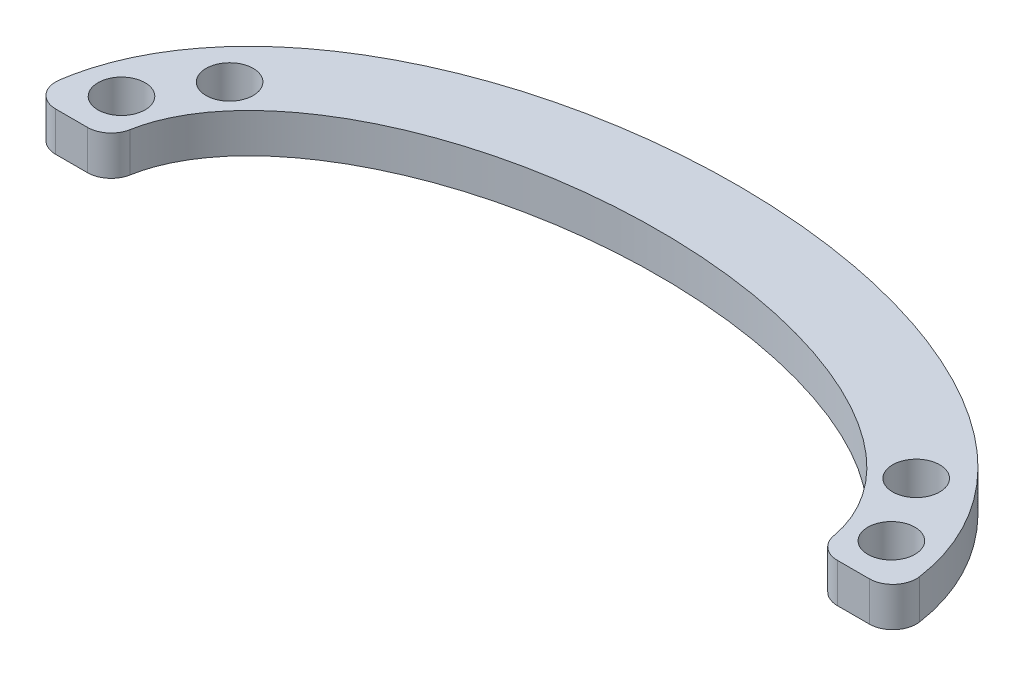
ISO-10303-21;
HEADER;
FILE_DESCRIPTION(('STEP AP214'),'2;1');
FILE_NAME('part.step','',(''),(''),'','','');
FILE_SCHEMA(('AUTOMOTIVE_DESIGN { 1 0 10303 214 1 1 1 1 }'));
ENDSEC;
DATA;
#1=APPLICATION_CONTEXT('core data for automotive mechanical design processes');
#2=APPLICATION_PROTOCOL_DEFINITION('international standard','automotive_design',2000,#1);
#3=PRODUCT_CONTEXT('',#1,'mechanical');
#4=PRODUCT('Part','Part','',(#3));
#5=PRODUCT_RELATED_PRODUCT_CATEGORY('part','',(#4));
#6=PRODUCT_DEFINITION_FORMATION('','',#4);
#7=PRODUCT_DEFINITION_CONTEXT('part definition',#1,'design');
#8=PRODUCT_DEFINITION('design','',#6,#7);
#9=PRODUCT_DEFINITION_SHAPE('','',#8);
#10=(LENGTH_UNIT() NAMED_UNIT(*) SI_UNIT(.MILLI.,.METRE.));
#11=(NAMED_UNIT(*) PLANE_ANGLE_UNIT() SI_UNIT($,.RADIAN.));
#12=(NAMED_UNIT(*) SI_UNIT($,.STERADIAN.) SOLID_ANGLE_UNIT());
#13=UNCERTAINTY_MEASURE_WITH_UNIT(LENGTH_MEASURE(1.E-05),#10,'distance_accuracy_value','');
#14=(GEOMETRIC_REPRESENTATION_CONTEXT(3) GLOBAL_UNCERTAINTY_ASSIGNED_CONTEXT((#13)) GLOBAL_UNIT_ASSIGNED_CONTEXT((#10,
#11,#12)) REPRESENTATION_CONTEXT('',''));
#15=CARTESIAN_POINT('',(0.,0.,0.));
#16=DIRECTION('',(0.,0.,1.));
#17=DIRECTION('',(1.,0.,0.));
#18=AXIS2_PLACEMENT_3D('',#15,#16,#17);
#19=CARTESIAN_POINT('',(54.9997938139714,5.,0.0992526313511364));
#20=DIRECTION('',(0.,-1.,0.));
#21=DIRECTION('',(0.,0.,-1.));
#22=AXIS2_PLACEMENT_3D('',#19,#20,#21);
#23=PLANE('',#22);
#24=CARTESIAN_POINT('',(49.0014703684187,5.,-5.59216846283063));
#25=DIRECTION('',(0.,-1.,0.));
#26=DIRECTION('',(0.,0.,1.));
#27=AXIS2_PLACEMENT_3D('',#24,#25,#26);
#28=CIRCLE('',#27,3.);
#29=CARTESIAN_POINT('',(49.0014703684187,5.,-2.59216846283063));
#30=VERTEX_POINT('',#29);
#31=EDGE_CURVE('E243',#30,#30,#28,.T.);
#32=ORIENTED_EDGE('',*,*,#31,.T.);
#33=EDGE_LOOP('',(#32));
#34=FACE_BOUND('',#33,.T.);
#35=CARTESIAN_POINT('',(43.701014770333,5.,-14.0525110520827));
#36=DIRECTION('',(0.,-1.,0.));
#37=DIRECTION('',(0.,0.,1.));
#38=AXIS2_PLACEMENT_3D('',#35,#36,#37);
#39=CIRCLE('',#38,3.);
#40=CARTESIAN_POINT('',(43.701014770333,5.,-11.0525110520827));
#41=VERTEX_POINT('',#40);
#42=EDGE_CURVE('E241',#41,#41,#39,.T.);
#43=ORIENTED_EDGE('',*,*,#42,.T.);
#44=EDGE_LOOP('',(#43));
#45=FACE_BOUND('',#44,.T.);
#46=CARTESIAN_POINT('',(-49.0014703684187,5.,-5.59216846283063));
#47=DIRECTION('',(0.,1.,0.));
#48=DIRECTION('',(0.,0.,1.));
#49=AXIS2_PLACEMENT_3D('',#46,#47,#48);
#50=CIRCLE('',#49,3.);
#51=CARTESIAN_POINT('',(-49.0014703684187,5.,-2.59216846283063));
#52=VERTEX_POINT('',#51);
#53=EDGE_CURVE('E250',#52,#52,#50,.T.);
#54=ORIENTED_EDGE('',*,*,#53,.F.);
#55=EDGE_LOOP('',(#54));
#56=FACE_BOUND('',#55,.T.);
#57=CARTESIAN_POINT('',(-43.701014770333,5.,-14.0525110520827));
#58=DIRECTION('',(0.,1.,0.));
#59=DIRECTION('',(0.,0.,1.));
#60=AXIS2_PLACEMENT_3D('',#57,#58,#59);
#61=CIRCLE('',#60,3.);
#62=CARTESIAN_POINT('',(-43.701014770333,5.,-11.0525110520827));
#63=VERTEX_POINT('',#62);
#64=EDGE_CURVE('E256',#63,#63,#61,.T.);
#65=ORIENTED_EDGE('',*,*,#64,.F.);
#66=EDGE_LOOP('',(#65));
#67=FACE_BOUND('',#66,.T.);
#68=CARTESIAN_POINT('',(0.,5.,0.));
#69=DIRECTION('',(0.,1.,0.));
#70=DIRECTION('',(1.,0.,0.));
#71=AXIS2_PLACEMENT_3D('',#68,#69,#70);
#72=ELLIPSE('',#71,45.,25.);
#73=CARTESIAN_POINT('',(44.7795008874869,5.,-2.47183519239893));
#74=VERTEX_POINT('',#73);
#75=CARTESIAN_POINT('',(-44.7795008874869,5.,-2.47183519239892));
#76=VERTEX_POINT('',#75);
#77=EDGE_CURVE('E164',#74,#76,#72,.T.);
#78=ORIENTED_EDGE('',*,*,#77,.F.);
#79=CARTESIAN_POINT('',(47.7326419162912,5.,-3.0000000000041));
#80=DIRECTION('',(0.,-1.,0.));
#81=DIRECTION('',(0.,0.,-1.));
#82=AXIS2_PLACEMENT_3D('',#79,#80,#81);
#83=CIRCLE('',#82,3.);
#84=CARTESIAN_POINT('',(47.7326419162912,5.,-4.09734638638987E-12));
#85=VERTEX_POINT('',#84);
#86=EDGE_CURVE('E52',#74,#85,#83,.F.);
#87=ORIENTED_EDGE('',*,*,#86,.T.);
#88=DIRECTION('',(-1.,0.,0.));
#89=VECTOR('',#88,1.);
#90=CARTESIAN_POINT('',(55.0000002617232,5.,-4.09823638110347E-12));
#91=LINE('',#90,#89);
#92=CARTESIAN_POINT('',(51.7838755501169,5.,-4.09784251942009E-12));
#93=VERTEX_POINT('',#92);
#94=EDGE_CURVE('E133',#93,#85,#91,.T.);
#95=ORIENTED_EDGE('',*,*,#94,.F.);
#96=CARTESIAN_POINT('',(51.7838755501169,5.,-3.00000000000397));
#97=DIRECTION('',(0.,-1.,0.));
#98=DIRECTION('',(0.,0.,-1.));
#99=AXIS2_PLACEMENT_3D('',#96,#97,#98);
#100=CIRCLE('',#99,3.);
#101=CARTESIAN_POINT('',(54.7530928049076,5.,-3.42865941475347));
#102=VERTEX_POINT('',#101);
#103=EDGE_CURVE('E59',#93,#102,#100,.F.);
#104=ORIENTED_EDGE('',*,*,#103,.T.);
#105=CARTESIAN_POINT('',(-55.,5.,0.));
#106=CARTESIAN_POINT('',(-55.,5.,1.51839004587295));
#107=CARTESIAN_POINT('',(-54.8560824878836,5.,3.01126789041497));
#108=CARTESIAN_POINT('',(-54.4384196051892,5.,5.2148140226484));
#109=CARTESIAN_POINT('',(-54.2654118343232,5.,5.94334002541323));
#110=CARTESIAN_POINT('',(-53.9557489127903,5.,7.02723873430152));
#111=CARTESIAN_POINT('',(-53.8441617057927,5.,7.3870552250377));
#112=CARTESIAN_POINT('',(-53.6042545379376,5.,8.10372199774911));
#113=CARTESIAN_POINT('',(-53.4756356643839,5.,8.46127527787602));
#114=CARTESIAN_POINT('',(-52.7968168979553,5.,10.2260969988139));
#115=CARTESIAN_POINT('',(-52.1375268766547,5.,11.5742085055168));
#116=CARTESIAN_POINT('',(-50.9945389890282,5.,13.511889744759));
#117=CARTESIAN_POINT('',(-50.5877443171271,5.,14.143634903753));
#118=CARTESIAN_POINT('',(-49.7247658837706,5.,15.3800391438514));
#119=CARTESIAN_POINT('',(-49.2670809389217,5.,15.9863082132591));
#120=CARTESIAN_POINT('',(-47.8432674447431,5.,17.7415324536667));
#121=CARTESIAN_POINT('',(-46.8221701298986,5.,18.8348330741654));
#122=CARTESIAN_POINT('',(-44.6584427358043,5.,20.8915153498061));
#123=CARTESIAN_POINT('',(-43.5156810565625,5.,21.85475632408));
#124=CARTESIAN_POINT('',(-41.1229374449941,5.,23.6666194337144));
#125=CARTESIAN_POINT('',(-39.8685055112097,5.,24.5171502589666));
#126=CARTESIAN_POINT('',(-37.3136126978861,5.,26.0850541054977));
#127=CARTESIAN_POINT('',(-36.0076876258533,5.,26.807071771656));
#128=CARTESIAN_POINT('',(-32.0162249036844,5.,28.8128721428701));
#129=CARTESIAN_POINT('',(-29.2577428708342,5.,29.938018335481));
#130=CARTESIAN_POINT('',(-25.0000132266153,5.,31.3647521038685));
#131=CARTESIAN_POINT('',(-23.5561053812594,5.,31.7973865779849));
#132=CARTESIAN_POINT('',(-20.6617609218868,5.,32.571728847771));
#133=CARTESIAN_POINT('',(-19.2094143576161,5.,32.9143925044692));
#134=CARTESIAN_POINT('',(-14.8381490768705,5.,33.8200208722962));
#135=CARTESIAN_POINT('',(-11.9051113125477,5.,34.2615393947465));
#136=CARTESIAN_POINT('',(-6.00487674782412,5.,34.8507545909456));
#137=CARTESIAN_POINT('',(-3.03765424271733,5.,34.9982301634831));
#138=CARTESIAN_POINT('',(1.43859136500834,5.,35.0008613366531));
#139=CARTESIAN_POINT('',(2.93742950124633,5.,34.9649827989931));
#140=CARTESIAN_POINT('',(5.93274243076342,5.,34.818477910016));
#141=CARTESIAN_POINT('',(7.42232041397916,5.,34.7083189066517));
#142=CARTESIAN_POINT('',(11.8668118591396,5.,34.2670899669549));
#143=CARTESIAN_POINT('',(14.7976800583453,5.,33.8261692003324));
#144=CARTESIAN_POINT('',(20.590703377887,5.,32.6304118306277));
#145=CARTESIAN_POINT('',(23.4529806199709,5.,31.8761331409922));
#146=CARTESIAN_POINT('',(27.6858267359427,5.,30.4680020970972));
#147=CARTESIAN_POINT('',(29.0866121337407,5.,29.9521939919706));
#148=CARTESIAN_POINT('',(31.1704839851247,5.,29.0994182184045));
#149=CARTESIAN_POINT('',(31.8636100681559,5.,28.8012951396562));
#150=CARTESIAN_POINT('',(33.2354068818576,5.,28.1803073415523));
#151=CARTESIAN_POINT('',(33.9139897397978,5.,27.8575592398411));
#152=CARTESIAN_POINT('',(37.2685182320089,5.,26.1795190666362));
#153=CARTESIAN_POINT('',(39.8315738319208,5.,24.6351260300423));
#154=CARTESIAN_POINT('',(42.8363856511167,5.,22.3712789629488));
#155=CARTESIAN_POINT('',(43.4288197160655,5.,21.9001912215936));
#156=CARTESIAN_POINT('',(44.5818359345461,5.,20.9291180391796));
#157=CARTESIAN_POINT('',(45.1425211400724,5.,20.4292335071571));
#158=CARTESIAN_POINT('',(46.7744855540985,5.,18.8841580578949));
#159=CARTESIAN_POINT('',(47.7959389951299,5.,17.7937859794949));
#160=CARTESIAN_POINT('',(49.2139074585589,5.,16.0546626304643));
#161=CARTESIAN_POINT('',(49.6674694737544,5.,15.4576406056893));
#162=CARTESIAN_POINT('',(50.5330551815444,5.,14.2259303094738));
#163=CARTESIAN_POINT('',(50.946683634309,5.,13.5883553089372));
#164=CARTESIAN_POINT('',(52.1030475401389,5.,11.6412381258365));
#165=CARTESIAN_POINT('',(52.764010936102,5.,10.2961184406788));
#166=CARTESIAN_POINT('',(53.5778616761583,5.,8.2024531969332));
#167=CARTESIAN_POINT('',(53.8194592590881,5.,7.49186329891521));
#168=CARTESIAN_POINT('',(54.2397970358985,5.,6.04378927111584));
#169=CARTESIAN_POINT('',(54.4189616867767,5.,5.30281513189762));
#170=CARTESIAN_POINT('',(54.8477956849531,5.,3.08198841950998));
#171=CARTESIAN_POINT('',(54.9935825615411,5.,1.59421705946039));
#172=CARTESIAN_POINT('',(55.0028994401866,5.,-0.648229582701819));
#173=CARTESIAN_POINT('',(54.9709777340296,5.,-1.39751693993318));
#174=CARTESIAN_POINT('',(54.8355311766655,5.,-2.89978174210758));
#175=CARTESIAN_POINT('',(54.7312101463596,5.,-3.65513730063713));
#176=CARTESIAN_POINT('',(54.3176675050862,5.,-5.87938075701824));
#177=CARTESIAN_POINT('',(53.9080049173847,5.,-7.32135875862256));
#178=CARTESIAN_POINT('',(53.1067938549724,5.,-9.42738972657926));
#179=CARTESIAN_POINT('',(52.8084706819811,5.,-10.1198700661698));
#180=CARTESIAN_POINT('',(52.1503410639576,5.,-11.4860825311862));
#181=CARTESIAN_POINT('',(51.793916741936,5.,-12.1526750024055));
#182=CARTESIAN_POINT('',(50.6521515294883,5.,-14.0998541508456));
#183=CARTESIAN_POINT('',(49.793124954525,5.,-15.3311865770672));
#184=CARTESIAN_POINT('',(48.3746509388096,5.,-17.0894991277231));
#185=CARTESIAN_POINT('',(47.8786513479277,5.,-17.6622831075638));
#186=CARTESIAN_POINT('',(46.8519671126504,5.,-18.7722031270453));
#187=CARTESIAN_POINT('',(46.3232138209188,5.,-19.307510400669));
#188=CARTESIAN_POINT('',(44.6949341708425,5.,-20.8598474951292));
#189=CARTESIAN_POINT('',(43.5535825535889,5.,-21.8235406414588));
#190=CARTESIAN_POINT('',(41.175471607311,5.,-23.6292605009408));
#191=CARTESIAN_POINT('',(39.93862936773,5.,-24.4711814843623));
#192=CARTESIAN_POINT('',(38.0198144529494,5.,-25.6530203380337));
#193=CARTESIAN_POINT('',(37.3683445432004,5.,-26.0340957323593));
#194=CARTESIAN_POINT('',(36.0510842760311,5.,-26.7671571489267));
#195=CARTESIAN_POINT('',(35.3869091638545,5.,-27.1183324486823));
#196=CARTESIAN_POINT('',(32.0404540604809,5.,-28.8033729075397));
#197=CARTESIAN_POINT('',(29.2825185657406,5.,-29.9277293832388));
#198=CARTESIAN_POINT('',(23.6389422042954,5.,-31.8227947731154));
#199=CARTESIAN_POINT('',(20.75289046333,5.,-32.592365875484));
#200=CARTESIAN_POINT('',(16.3384345421875,5.,-33.510289005797));
#201=CARTESIAN_POINT('',(14.8618248824642,5.,-33.7745547407185));
#202=CARTESIAN_POINT('',(11.9097943033404,5.,-34.2235334317811));
#203=CARTESIAN_POINT('',(10.4325772973154,5.,-34.4086042386756));
#204=CARTESIAN_POINT('',(5.99750111252647,5.,-34.8514648104824));
#205=CARTESIAN_POINT('',(3.03624022072525,5.,-34.9976720508059));
#206=CARTESIAN_POINT('',(-2.8950558615939,5.,-35.0022731881165));
#207=CARTESIAN_POINT('',(-5.86508995217778,5.,-34.8607031649931));
#208=CARTESIAN_POINT('',(-9.58340789296066,5.,-34.494299133632));
#209=CARTESIAN_POINT('',(-10.3273622832467,5.,-34.4114794757835));
#210=CARTESIAN_POINT('',(-11.8158687398803,5.,-34.2262352718771));
#211=CARTESIAN_POINT('',(-12.561129917708,5.,-34.1236820952234));
#212=CARTESIAN_POINT('',(-14.7862399547533,5.,-33.7875026742884));
#213=CARTESIAN_POINT('',(-16.2586607274226,5.,-33.5250888936433));
#214=CARTESIAN_POINT('',(-20.6417939345861,5.,-32.6188820017192));
#215=CARTESIAN_POINT('',(-23.5187629379187,5.,-31.8574677234266));
#216=CARTESIAN_POINT('',(-27.7560748528734,5.,-30.4429642542247));
#217=CARTESIAN_POINT('',(-29.1554047484691,5.,-29.9257739448303));
#218=CARTESIAN_POINT('',(-31.232361405774,5.,-29.0731688723766));
#219=CARTESIAN_POINT('',(-31.9209981411619,5.,-28.7761321256695));
#220=CARTESIAN_POINT('',(-33.2903765148076,5.,-28.1545382970026));
#221=CARTESIAN_POINT('',(-33.9717807388915,5.,-27.8295878365138));
#222=CARTESIAN_POINT('',(-37.3315198826316,5.,-26.1440393497041));
#223=CARTESIAN_POINT('',(-39.8895166584386,5.,-24.596240674858));
#224=CARTESIAN_POINT('',(-42.8772234646412,5.,-22.3392634928072));
#225=CARTESIAN_POINT('',(-43.4641209639799,5.,-21.8715194557372));
#226=CARTESIAN_POINT('',(-44.6146763449347,5.,-20.9003361392941));
#227=CARTESIAN_POINT('',(-45.1797128530363,5.,-20.3954722381051));
#228=CARTESIAN_POINT('',(-46.8181713342694,5.,-18.8397351659298));
#229=CARTESIAN_POINT('',(-47.8397779520209,5.,-17.7446074517688));
#230=CARTESIAN_POINT('',(-49.7241272863949,5.,-15.4240915876147));
#231=CARTESIAN_POINT('',(-50.587056231705,5.,-14.1988561358105));
#232=CARTESIAN_POINT('',(-51.7419687641319,5.,-12.2466356234778));
#233=CARTESIAN_POINT('',(-52.1018209024854,5.,-11.5791702854066));
#234=CARTESIAN_POINT('',(-52.7598542536184,5.,-10.2273741681771));
#235=CARTESIAN_POINT('',(-53.0595368272148,5.,-9.54058312343684));
#236=CARTESIAN_POINT('',(-53.8678103987848,5.,-7.44650172880927));
#237=CARTESIAN_POINT('',(-54.2862273582951,5.,-6.00572596488512));
#238=CARTESIAN_POINT('',(-54.8557270897404,5.,-3.02490200663786));
#239=CARTESIAN_POINT('',(-55.,5.,-1.51839004587301));
#240=CARTESIAN_POINT('',(-55.,5.,0.));
#241=B_SPLINE_CURVE_WITH_KNOTS('',3,(#105,#106,#107,#108,#109,#110,#111,#112,#113,#114,#115,
#116,#117,#118,#119,#120,#121,#122,#123,#124,#125,#126,#127,#128,#129,#130,#131,#132,#133,#134,
#135,#136,#137,#138,#139,#140,#141,#142,#143,#144,#145,#146,#147,#148,#149,#150,#151,#152,#153,
#154,#155,#156,#157,#158,#159,#160,#161,#162,#163,#164,#165,#166,#167,#168,#169,#170,#171,#172,
#173,#174,#175,#176,#177,#178,#179,#180,#181,#182,#183,#184,#185,#186,#187,#188,#189,#190,#191,
#192,#193,#194,#195,#196,#197,#198,#199,#200,#201,#202,#203,#204,#205,#206,#207,#208,#209,#210,
#211,#212,#213,#214,#215,#216,#217,#218,#219,#220,#221,#222,#223,#224,#225,#226,#227,#228,#229,
#230,#231,#232,#233,#234,#235,#236,#237,#238,#239,#240),.UNSPECIFIED.,.T.,.F.,(4,2,2,2,2,2,2,2,
2,2,2,2,2,2,2,2,2,2,2,2,2,2,2,2,2,2,2,2,2,2,2,2,2,2,2,2,2,2,2,2,2,2,2,2,2,2,2,2,2,2,2,2,2,2,2,2,
2,2,2,2,2,2,2,2,2,2,2,4),(0.,0.0156249999999999,0.0234374999999998,0.0273437499999997,
0.0312499999999997,0.0468749999999996,0.0546874999999995,0.0624999999999995,0.0781249999999994,
0.0937499999999993,0.109374999999999,0.124999999999999,0.156249999999999,0.171874999999999,
0.187499999999999,0.218749999999998,0.249999999999998,0.265624999999998,0.281249999999998,
0.312499999999997,0.343749999999997,0.359374999999997,0.367187499999997,0.374999999999997,
0.406249999999996,0.414062499999996,0.421874999999996,0.437499999999996,0.445312499999996,
0.453124999999996,0.468749999999996,0.476562499999996,0.484374999999996,0.499999999999996,
0.507812499999996,0.515624999999996,0.531249999999996,0.539062499999996,0.546874999999996,
0.562499999999996,0.570312499999996,0.578124999999996,0.593749999999996,0.609374999999996,
0.617187499999996,0.624999999999996,0.656249999999997,0.687499999999997,0.703124999999997,
0.718749999999997,0.749999999999997,0.781249999999998,0.789062499999998,0.796874999999998,
0.812499999999998,0.843749999999998,0.859374999999998,0.867187499999998,0.874999999999998,
0.906249999999999,0.914062499999999,0.921874999999999,0.937499999999999,0.953124999999999,
0.960937499999999,0.96875,0.984375,1.),.UNSPECIFIED.);
#242=CARTESIAN_POINT('',(-54.7531861664009,5.,-3.42901832718332));
#243=VERTEX_POINT('',#242);
#244=EDGE_CURVE('E141',#102,#243,#241,.T.);
#245=ORIENTED_EDGE('',*,*,#244,.T.);
#246=CARTESIAN_POINT('',(-51.7840207491592,5.,-3.00000000000407));
#247=DIRECTION('',(0.,-1.,0.));
#248=DIRECTION('',(0.,0.,-1.));
#249=AXIS2_PLACEMENT_3D('',#246,#247,#248);
#250=CIRCLE('',#249,3.);
#251=CARTESIAN_POINT('',(-51.7840207491592,5.,-4.08515911015036E-12));
#252=VERTEX_POINT('',#251);
#253=EDGE_CURVE('E138',#243,#252,#250,.F.);
#254=ORIENTED_EDGE('',*,*,#253,.T.);
#255=CARTESIAN_POINT('',(-47.7326419162912,5.,-4.08565526096234E-12));
#256=VERTEX_POINT('',#255);
#257=EDGE_CURVE('E171',#256,#252,#91,.T.);
#258=ORIENTED_EDGE('',*,*,#257,.F.);
#259=CARTESIAN_POINT('',(-47.7326419162912,5.,-3.00000000000408));
#260=DIRECTION('',(0.,-1.,0.));
#261=DIRECTION('',(0.,0.,-1.));
#262=AXIS2_PLACEMENT_3D('',#259,#260,#261);
#263=CIRCLE('',#262,3.);
#264=EDGE_CURVE('E137',#256,#76,#263,.F.);
#265=ORIENTED_EDGE('',*,*,#264,.T.);
#266=EDGE_LOOP('',(#78,#87,#95,#104,#245,#254,#258,#265));
#267=FACE_BOUND('',#266,.T.);
#268=ADVANCED_FACE('F44',(#34,#45,#56,#67,#267),#23,.F.);
#269=CARTESIAN_POINT('',(54.9997938139714,0.,0.0992526313511364));
#270=DIRECTION('',(0.,-1.,0.));
#271=DIRECTION('',(0.,0.,-1.));
#272=AXIS2_PLACEMENT_3D('',#269,#270,#271);
#273=PLANE('',#272);
#274=CARTESIAN_POINT('',(49.0014703684187,0.,-5.59216846283063));
#275=DIRECTION('',(0.,-1.,0.));
#276=DIRECTION('',(0.,0.,1.));
#277=AXIS2_PLACEMENT_3D('',#274,#275,#276);
#278=CIRCLE('',#277,3.);
#279=CARTESIAN_POINT('',(49.0014703684187,0.,-2.59216846283063));
#280=VERTEX_POINT('',#279);
#281=EDGE_CURVE('E258',#280,#280,#278,.T.);
#282=ORIENTED_EDGE('',*,*,#281,.F.);
#283=EDGE_LOOP('',(#282));
#284=FACE_BOUND('',#283,.T.);
#285=CARTESIAN_POINT('',(43.701014770333,0.,-14.0525110520827));
#286=DIRECTION('',(0.,-1.,0.));
#287=DIRECTION('',(0.,0.,1.));
#288=AXIS2_PLACEMENT_3D('',#285,#286,#287);
#289=CIRCLE('',#288,3.);
#290=CARTESIAN_POINT('',(43.701014770333,0.,-11.0525110520827));
#291=VERTEX_POINT('',#290);
#292=EDGE_CURVE('E238',#291,#291,#289,.T.);
#293=ORIENTED_EDGE('',*,*,#292,.F.);
#294=EDGE_LOOP('',(#293));
#295=FACE_BOUND('',#294,.T.);
#296=CARTESIAN_POINT('',(-49.0014703684187,0.,-5.59216846283063));
#297=DIRECTION('',(0.,1.,0.));
#298=DIRECTION('',(0.,0.,1.));
#299=AXIS2_PLACEMENT_3D('',#296,#297,#298);
#300=CIRCLE('',#299,3.);
#301=CARTESIAN_POINT('',(-49.0014703684187,0.,-2.59216846283063));
#302=VERTEX_POINT('',#301);
#303=EDGE_CURVE('E247',#302,#302,#300,.T.);
#304=ORIENTED_EDGE('',*,*,#303,.T.);
#305=EDGE_LOOP('',(#304));
#306=FACE_BOUND('',#305,.T.);
#307=CARTESIAN_POINT('',(-43.701014770333,0.,-14.0525110520827));
#308=DIRECTION('',(0.,1.,0.));
#309=DIRECTION('',(0.,0.,1.));
#310=AXIS2_PLACEMENT_3D('',#307,#308,#309);
#311=CIRCLE('',#310,3.);
#312=CARTESIAN_POINT('',(-43.701014770333,0.,-11.0525110520827));
#313=VERTEX_POINT('',#312);
#314=EDGE_CURVE('E253',#313,#313,#311,.T.);
#315=ORIENTED_EDGE('',*,*,#314,.T.);
#316=EDGE_LOOP('',(#315));
#317=FACE_BOUND('',#316,.T.);
#318=DIRECTION('',(-1.,0.,0.));
#319=VECTOR('',#318,1.);
#320=CARTESIAN_POINT('',(55.0000002617232,0.,-4.09823638110347E-12));
#321=LINE('',#320,#319);
#322=CARTESIAN_POINT('',(51.7838755501169,0.,-4.09784251942009E-12));
#323=VERTEX_POINT('',#322);
#324=CARTESIAN_POINT('',(47.7326419162912,0.,-4.09734638638987E-12));
#325=VERTEX_POINT('',#324);
#326=EDGE_CURVE('E132',#323,#325,#321,.T.);
#327=ORIENTED_EDGE('',*,*,#326,.T.);
#328=CARTESIAN_POINT('',(47.7326419162912,0.,-3.0000000000041));
#329=DIRECTION('',(0.,-1.,0.));
#330=DIRECTION('',(0.,0.,-1.));
#331=AXIS2_PLACEMENT_3D('',#328,#329,#330);
#332=CIRCLE('',#331,3.);
#333=CARTESIAN_POINT('',(44.7795008874869,0.,-2.47183519239893));
#334=VERTEX_POINT('',#333);
#335=EDGE_CURVE('E159',#325,#334,#332,.T.);
#336=ORIENTED_EDGE('',*,*,#335,.T.);
#337=CARTESIAN_POINT('',(0.,0.,0.));
#338=DIRECTION('',(0.,1.,0.));
#339=DIRECTION('',(1.,0.,0.));
#340=AXIS2_PLACEMENT_3D('',#337,#338,#339);
#341=ELLIPSE('',#340,45.,25.);
#342=CARTESIAN_POINT('',(-44.7795008874869,0.,-2.47183519239892));
#343=VERTEX_POINT('',#342);
#344=EDGE_CURVE('E116',#334,#343,#341,.T.);
#345=ORIENTED_EDGE('',*,*,#344,.T.);
#346=CARTESIAN_POINT('',(-47.7326419162912,0.,-3.00000000000408));
#347=DIRECTION('',(0.,-1.,0.));
#348=DIRECTION('',(0.,0.,-1.));
#349=AXIS2_PLACEMENT_3D('',#346,#347,#348);
#350=CIRCLE('',#349,3.);
#351=CARTESIAN_POINT('',(-47.7326419162912,0.,-4.08565526096234E-12));
#352=VERTEX_POINT('',#351);
#353=EDGE_CURVE('E109',#343,#352,#350,.T.);
#354=ORIENTED_EDGE('',*,*,#353,.T.);
#355=CARTESIAN_POINT('',(-51.7840207491592,0.,-4.08515911015036E-12));
#356=VERTEX_POINT('',#355);
#357=EDGE_CURVE('E114',#352,#356,#321,.T.);
#358=ORIENTED_EDGE('',*,*,#357,.T.);
#359=CARTESIAN_POINT('',(-51.7840207491592,0.,-3.00000000000407));
#360=DIRECTION('',(0.,-1.,0.));
#361=DIRECTION('',(0.,0.,-1.));
#362=AXIS2_PLACEMENT_3D('',#359,#360,#361);
#363=CIRCLE('',#362,3.);
#364=CARTESIAN_POINT('',(-54.7531861664012,0.,-3.42901832718172));
#365=VERTEX_POINT('',#364);
#366=EDGE_CURVE('E122',#356,#365,#363,.T.);
#367=ORIENTED_EDGE('',*,*,#366,.T.);
#368=CARTESIAN_POINT('',(-55.,0.,0.));
#369=CARTESIAN_POINT('',(-55.,0.,1.51839004587295));
#370=CARTESIAN_POINT('',(-54.8560824878836,0.,3.01126789041497));
#371=CARTESIAN_POINT('',(-54.4384196051892,0.,5.2148140226484));
#372=CARTESIAN_POINT('',(-54.2654118343232,0.,5.94334002541323));
#373=CARTESIAN_POINT('',(-53.9557489127903,0.,7.02723873430152));
#374=CARTESIAN_POINT('',(-53.8441617057927,0.,7.3870552250377));
#375=CARTESIAN_POINT('',(-53.6042545379376,0.,8.10372199774911));
#376=CARTESIAN_POINT('',(-53.4756356643839,0.,8.46127527787602));
#377=CARTESIAN_POINT('',(-52.7968168979553,0.,10.2260969988139));
#378=CARTESIAN_POINT('',(-52.1375268766547,0.,11.5742085055168));
#379=CARTESIAN_POINT('',(-50.9945389890282,0.,13.511889744759));
#380=CARTESIAN_POINT('',(-50.5877443171271,0.,14.143634903753));
#381=CARTESIAN_POINT('',(-49.7247658837706,0.,15.3800391438514));
#382=CARTESIAN_POINT('',(-49.2670809389217,0.,15.9863082132591));
#383=CARTESIAN_POINT('',(-47.8432674447431,0.,17.7415324536667));
#384=CARTESIAN_POINT('',(-46.8221701298986,0.,18.8348330741654));
#385=CARTESIAN_POINT('',(-44.6584427358043,0.,20.8915153498061));
#386=CARTESIAN_POINT('',(-43.5156810565625,0.,21.85475632408));
#387=CARTESIAN_POINT('',(-41.1229374449941,0.,23.6666194337144));
#388=CARTESIAN_POINT('',(-39.8685055112097,0.,24.5171502589666));
#389=CARTESIAN_POINT('',(-37.3136126978861,0.,26.0850541054977));
#390=CARTESIAN_POINT('',(-36.0076876258533,0.,26.807071771656));
#391=CARTESIAN_POINT('',(-32.0162249036844,0.,28.8128721428701));
#392=CARTESIAN_POINT('',(-29.2577428708342,0.,29.938018335481));
#393=CARTESIAN_POINT('',(-25.0000132266153,0.,31.3647521038685));
#394=CARTESIAN_POINT('',(-23.5561053812594,0.,31.7973865779849));
#395=CARTESIAN_POINT('',(-20.6617609218868,0.,32.571728847771));
#396=CARTESIAN_POINT('',(-19.2094143576161,0.,32.9143925044692));
#397=CARTESIAN_POINT('',(-14.8381490768705,0.,33.8200208722962));
#398=CARTESIAN_POINT('',(-11.9051113125477,0.,34.2615393947465));
#399=CARTESIAN_POINT('',(-6.00487674782412,0.,34.8507545909456));
#400=CARTESIAN_POINT('',(-3.03765424271733,0.,34.9982301634831));
#401=CARTESIAN_POINT('',(1.43859136500834,0.,35.0008613366531));
#402=CARTESIAN_POINT('',(2.93742950124633,0.,34.9649827989931));
#403=CARTESIAN_POINT('',(5.93274243076342,0.,34.818477910016));
#404=CARTESIAN_POINT('',(7.42232041397916,0.,34.7083189066517));
#405=CARTESIAN_POINT('',(11.8668118591396,0.,34.2670899669549));
#406=CARTESIAN_POINT('',(14.7976800583453,0.,33.8261692003324));
#407=CARTESIAN_POINT('',(20.590703377887,0.,32.6304118306277));
#408=CARTESIAN_POINT('',(23.4529806199709,0.,31.8761331409922));
#409=CARTESIAN_POINT('',(27.6858267359427,0.,30.4680020970972));
#410=CARTESIAN_POINT('',(29.0866121337407,0.,29.9521939919706));
#411=CARTESIAN_POINT('',(31.1704839851247,0.,29.0994182184045));
#412=CARTESIAN_POINT('',(31.8636100681559,0.,28.8012951396562));
#413=CARTESIAN_POINT('',(33.2354068818576,0.,28.1803073415523));
#414=CARTESIAN_POINT('',(33.9139897397978,0.,27.8575592398411));
#415=CARTESIAN_POINT('',(37.2685182320089,0.,26.1795190666362));
#416=CARTESIAN_POINT('',(39.8315738319208,0.,24.6351260300423));
#417=CARTESIAN_POINT('',(42.8363856511167,0.,22.3712789629488));
#418=CARTESIAN_POINT('',(43.4288197160655,0.,21.9001912215936));
#419=CARTESIAN_POINT('',(44.5818359345461,0.,20.9291180391796));
#420=CARTESIAN_POINT('',(45.1425211400724,0.,20.4292335071571));
#421=CARTESIAN_POINT('',(46.7744855540985,0.,18.8841580578949));
#422=CARTESIAN_POINT('',(47.7959389951299,0.,17.7937859794949));
#423=CARTESIAN_POINT('',(49.2139074585589,0.,16.0546626304643));
#424=CARTESIAN_POINT('',(49.6674694737544,0.,15.4576406056893));
#425=CARTESIAN_POINT('',(50.5330551815444,0.,14.2259303094738));
#426=CARTESIAN_POINT('',(50.946683634309,0.,13.5883553089372));
#427=CARTESIAN_POINT('',(52.1030475401389,0.,11.6412381258365));
#428=CARTESIAN_POINT('',(52.764010936102,0.,10.2961184406788));
#429=CARTESIAN_POINT('',(53.5778616761583,0.,8.2024531969332));
#430=CARTESIAN_POINT('',(53.8194592590881,0.,7.49186329891521));
#431=CARTESIAN_POINT('',(54.2397970358985,0.,6.04378927111584));
#432=CARTESIAN_POINT('',(54.4189616867767,0.,5.30281513189762));
#433=CARTESIAN_POINT('',(54.8477956849531,0.,3.08198841950998));
#434=CARTESIAN_POINT('',(54.9935825615411,0.,1.59421705946039));
#435=CARTESIAN_POINT('',(55.0028994401866,0.,-0.648229582701819));
#436=CARTESIAN_POINT('',(54.9709777340296,0.,-1.39751693993318));
#437=CARTESIAN_POINT('',(54.8355311766655,0.,-2.89978174210758));
#438=CARTESIAN_POINT('',(54.7312101463596,0.,-3.65513730063713));
#439=CARTESIAN_POINT('',(54.3176675050862,0.,-5.87938075701824));
#440=CARTESIAN_POINT('',(53.9080049173847,0.,-7.32135875862256));
#441=CARTESIAN_POINT('',(53.1067938549724,0.,-9.42738972657926));
#442=CARTESIAN_POINT('',(52.8084706819811,0.,-10.1198700661698));
#443=CARTESIAN_POINT('',(52.1503410639576,0.,-11.4860825311862));
#444=CARTESIAN_POINT('',(51.793916741936,0.,-12.1526750024055));
#445=CARTESIAN_POINT('',(50.6521515294883,0.,-14.0998541508456));
#446=CARTESIAN_POINT('',(49.793124954525,0.,-15.3311865770672));
#447=CARTESIAN_POINT('',(48.3746509388096,0.,-17.0894991277231));
#448=CARTESIAN_POINT('',(47.8786513479277,0.,-17.6622831075638));
#449=CARTESIAN_POINT('',(46.8519671126504,0.,-18.7722031270453));
#450=CARTESIAN_POINT('',(46.3232138209188,0.,-19.307510400669));
#451=CARTESIAN_POINT('',(44.6949341708425,0.,-20.8598474951292));
#452=CARTESIAN_POINT('',(43.5535825535889,0.,-21.8235406414588));
#453=CARTESIAN_POINT('',(41.175471607311,0.,-23.6292605009408));
#454=CARTESIAN_POINT('',(39.93862936773,0.,-24.4711814843623));
#455=CARTESIAN_POINT('',(38.0198144529494,0.,-25.6530203380337));
#456=CARTESIAN_POINT('',(37.3683445432004,0.,-26.0340957323593));
#457=CARTESIAN_POINT('',(36.0510842760311,0.,-26.7671571489267));
#458=CARTESIAN_POINT('',(35.3869091638545,0.,-27.1183324486823));
#459=CARTESIAN_POINT('',(32.0404540604809,0.,-28.8033729075397));
#460=CARTESIAN_POINT('',(29.2825185657406,0.,-29.9277293832388));
#461=CARTESIAN_POINT('',(23.6389422042954,0.,-31.8227947731154));
#462=CARTESIAN_POINT('',(20.75289046333,0.,-32.592365875484));
#463=CARTESIAN_POINT('',(16.3384345421875,0.,-33.510289005797));
#464=CARTESIAN_POINT('',(14.8618248824642,0.,-33.7745547407185));
#465=CARTESIAN_POINT('',(11.9097943033404,0.,-34.2235334317811));
#466=CARTESIAN_POINT('',(10.4325772973154,0.,-34.4086042386756));
#467=CARTESIAN_POINT('',(5.99750111252647,0.,-34.8514648104824));
#468=CARTESIAN_POINT('',(3.03624022072525,0.,-34.9976720508059));
#469=CARTESIAN_POINT('',(-2.8950558615939,0.,-35.0022731881165));
#470=CARTESIAN_POINT('',(-5.86508995217778,0.,-34.8607031649931));
#471=CARTESIAN_POINT('',(-9.58340789296066,0.,-34.494299133632));
#472=CARTESIAN_POINT('',(-10.3273622832467,0.,-34.4114794757835));
#473=CARTESIAN_POINT('',(-11.8158687398803,0.,-34.2262352718771));
#474=CARTESIAN_POINT('',(-12.561129917708,0.,-34.1236820952234));
#475=CARTESIAN_POINT('',(-14.7862399547533,0.,-33.7875026742884));
#476=CARTESIAN_POINT('',(-16.2586607274226,0.,-33.5250888936433));
#477=CARTESIAN_POINT('',(-20.6417939345861,0.,-32.6188820017192));
#478=CARTESIAN_POINT('',(-23.5187629379187,0.,-31.8574677234266));
#479=CARTESIAN_POINT('',(-27.7560748528734,0.,-30.4429642542247));
#480=CARTESIAN_POINT('',(-29.1554047484691,0.,-29.9257739448303));
#481=CARTESIAN_POINT('',(-31.232361405774,0.,-29.0731688723766));
#482=CARTESIAN_POINT('',(-31.9209981411619,0.,-28.7761321256695));
#483=CARTESIAN_POINT('',(-33.2903765148076,0.,-28.1545382970026));
#484=CARTESIAN_POINT('',(-33.9717807388915,0.,-27.8295878365138));
#485=CARTESIAN_POINT('',(-37.3315198826316,0.,-26.1440393497041));
#486=CARTESIAN_POINT('',(-39.8895166584386,0.,-24.596240674858));
#487=CARTESIAN_POINT('',(-42.8772234646412,0.,-22.3392634928072));
#488=CARTESIAN_POINT('',(-43.4641209639799,0.,-21.8715194557372));
#489=CARTESIAN_POINT('',(-44.6146763449347,0.,-20.9003361392941));
#490=CARTESIAN_POINT('',(-45.1797128530363,0.,-20.3954722381051));
#491=CARTESIAN_POINT('',(-46.8181713342694,0.,-18.8397351659298));
#492=CARTESIAN_POINT('',(-47.8397779520209,0.,-17.7446074517688));
#493=CARTESIAN_POINT('',(-49.7241272863949,0.,-15.4240915876147));
#494=CARTESIAN_POINT('',(-50.587056231705,0.,-14.1988561358105));
#495=CARTESIAN_POINT('',(-51.7419687641319,0.,-12.2466356234778));
#496=CARTESIAN_POINT('',(-52.1018209024854,0.,-11.5791702854066));
#497=CARTESIAN_POINT('',(-52.7598542536184,0.,-10.2273741681771));
#498=CARTESIAN_POINT('',(-53.0595368272148,0.,-9.54058312343684));
#499=CARTESIAN_POINT('',(-53.8678103987848,0.,-7.44650172880927));
#500=CARTESIAN_POINT('',(-54.2862273582951,0.,-6.00572596488512));
#501=CARTESIAN_POINT('',(-54.8557270897404,0.,-3.02490200663786));
#502=CARTESIAN_POINT('',(-55.,0.,-1.51839004587301));
#503=CARTESIAN_POINT('',(-55.,0.,0.));
#504=B_SPLINE_CURVE_WITH_KNOTS('',3,(#368,#369,#370,#371,#372,#373,#374,#375,#376,#377,#378,
#379,#380,#381,#382,#383,#384,#385,#386,#387,#388,#389,#390,#391,#392,#393,#394,#395,#396,#397,
#398,#399,#400,#401,#402,#403,#404,#405,#406,#407,#408,#409,#410,#411,#412,#413,#414,#415,#416,
#417,#418,#419,#420,#421,#422,#423,#424,#425,#426,#427,#428,#429,#430,#431,#432,#433,#434,#435,
#436,#437,#438,#439,#440,#441,#442,#443,#444,#445,#446,#447,#448,#449,#450,#451,#452,#453,#454,
#455,#456,#457,#458,#459,#460,#461,#462,#463,#464,#465,#466,#467,#468,#469,#470,#471,#472,#473,
#474,#475,#476,#477,#478,#479,#480,#481,#482,#483,#484,#485,#486,#487,#488,#489,#490,#491,#492,
#493,#494,#495,#496,#497,#498,#499,#500,#501,#502,#503),.UNSPECIFIED.,.T.,.F.,(4,2,2,2,2,2,2,2,
2,2,2,2,2,2,2,2,2,2,2,2,2,2,2,2,2,2,2,2,2,2,2,2,2,2,2,2,2,2,2,2,2,2,2,2,2,2,2,2,2,2,2,2,2,2,2,2,
2,2,2,2,2,2,2,2,2,2,2,4),(0.,0.0156249999999999,0.0234374999999998,0.0273437499999997,
0.0312499999999997,0.0468749999999996,0.0546874999999995,0.0624999999999995,0.0781249999999994,
0.0937499999999993,0.109374999999999,0.124999999999999,0.156249999999999,0.171874999999999,
0.187499999999999,0.218749999999998,0.249999999999998,0.265624999999998,0.281249999999998,
0.312499999999997,0.343749999999997,0.359374999999997,0.367187499999997,0.374999999999997,
0.406249999999996,0.414062499999996,0.421874999999996,0.437499999999996,0.445312499999996,
0.453124999999996,0.468749999999996,0.476562499999996,0.484374999999996,0.499999999999996,
0.507812499999996,0.515624999999996,0.531249999999996,0.539062499999996,0.546874999999996,
0.562499999999996,0.570312499999996,0.578124999999996,0.593749999999996,0.609374999999996,
0.617187499999996,0.624999999999996,0.656249999999997,0.687499999999997,0.703124999999997,
0.718749999999997,0.749999999999997,0.781249999999998,0.789062499999998,0.796874999999998,
0.812499999999998,0.843749999999998,0.859374999999998,0.867187499999998,0.874999999999998,
0.906249999999999,0.914062499999999,0.921874999999999,0.937499999999999,0.953124999999999,
0.960937499999999,0.96875,0.984375,1.),.UNSPECIFIED.);
#505=CARTESIAN_POINT('',(54.7530928049076,0.,-3.42865941475347));
#506=VERTEX_POINT('',#505);
#507=EDGE_CURVE('E176',#506,#365,#504,.T.);
#508=ORIENTED_EDGE('',*,*,#507,.F.);
#509=CARTESIAN_POINT('',(51.7838755501169,0.,-3.00000000000397));
#510=DIRECTION('',(0.,-1.,0.));
#511=DIRECTION('',(0.,0.,-1.));
#512=AXIS2_PLACEMENT_3D('',#509,#510,#511);
#513=CIRCLE('',#512,3.);
#514=EDGE_CURVE('E157',#506,#323,#513,.T.);
#515=ORIENTED_EDGE('',*,*,#514,.T.);
#516=EDGE_LOOP('',(#327,#336,#345,#354,#358,#367,#508,#515));
#517=FACE_BOUND('',#516,.T.);
#518=ADVANCED_FACE('F112',(#284,#295,#306,#317,#517),#273,.T.);
#519=DIRECTION('',(0.,-1.,0.));
#520=VECTOR('',#519,1.);
#521=SURFACE_OF_LINEAR_EXTRUSION('',#241,#520);
#522=ORIENTED_EDGE('',*,*,#244,.F.);
#523=DIRECTION('',(0.,-1.,0.));
#524=VECTOR('',#523,1.);
#525=CARTESIAN_POINT('',(54.7530928049076,5.,-3.42865941475347));
#526=LINE('',#525,#524);
#527=EDGE_CURVE('E12',#102,#506,#526,.T.);
#528=ORIENTED_EDGE('',*,*,#527,.T.);
#529=ORIENTED_EDGE('',*,*,#507,.T.);
#530=DIRECTION('',(0.,-1.,0.));
#531=VECTOR('',#530,1.);
#532=CARTESIAN_POINT('',(-54.7531861664012,0.,-3.42901832718172));
#533=LINE('',#532,#531);
#534=EDGE_CURVE('E121',#365,#243,#533,.F.);
#535=ORIENTED_EDGE('',*,*,#534,.T.);
#536=EDGE_LOOP('',(#522,#528,#529,#535));
#537=FACE_BOUND('',#536,.T.);
#538=ADVANCED_FACE('F189',(#537),#521,.F.);
#539=DIRECTION('',(0.,-1.,0.));
#540=VECTOR('',#539,1.);
#541=SURFACE_OF_LINEAR_EXTRUSION('',#72,#540);
#542=ORIENTED_EDGE('',*,*,#344,.F.);
#543=DIRECTION('',(0.,-1.,0.));
#544=VECTOR('',#543,1.);
#545=CARTESIAN_POINT('',(44.7795008874869,0.,-2.47183519239893));
#546=LINE('',#545,#544);
#547=EDGE_CURVE('E67',#334,#74,#546,.F.);
#548=ORIENTED_EDGE('',*,*,#547,.T.);
#549=ORIENTED_EDGE('',*,*,#77,.T.);
#550=DIRECTION('',(0.,-1.,0.));
#551=VECTOR('',#550,1.);
#552=CARTESIAN_POINT('',(-44.7795008874869,5.,-2.47183519239892));
#553=LINE('',#552,#551);
#554=EDGE_CURVE('E146',#76,#343,#553,.T.);
#555=ORIENTED_EDGE('',*,*,#554,.T.);
#556=EDGE_LOOP('',(#542,#548,#549,#555));
#557=FACE_BOUND('',#556,.T.);
#558=ADVANCED_FACE('F174',(#557),#541,.T.);
#559=CARTESIAN_POINT('',(55.0000002617232,0.,-4.09823638110347E-12));
#560=DIRECTION('',(0.,0.,-1.));
#561=DIRECTION('',(-1.,0.,0.));
#562=AXIS2_PLACEMENT_3D('',#559,#560,#561);
#563=PLANE('',#562);
#564=ORIENTED_EDGE('',*,*,#94,.T.);
#565=DIRECTION('',(0.,1.,0.));
#566=VECTOR('',#565,1.);
#567=CARTESIAN_POINT('',(47.7326419162912,0.,-4.09734638638987E-12));
#568=LINE('',#567,#566);
#569=EDGE_CURVE('E154',#85,#325,#568,.F.);
#570=ORIENTED_EDGE('',*,*,#569,.T.);
#571=ORIENTED_EDGE('',*,*,#326,.F.);
#572=DIRECTION('',(0.,-1.,0.));
#573=VECTOR('',#572,1.);
#574=CARTESIAN_POINT('',(51.7838755501169,0.,-4.09784251942009E-12));
#575=LINE('',#574,#573);
#576=EDGE_CURVE('E151',#323,#93,#575,.F.);
#577=ORIENTED_EDGE('',*,*,#576,.T.);
#578=EDGE_LOOP('',(#564,#570,#571,#577));
#579=FACE_BOUND('',#578,.T.);
#580=ADVANCED_FACE('F168',(#579),#563,.F.);
#581=ORIENTED_EDGE('',*,*,#357,.F.);
#582=DIRECTION('',(0.,1.,0.));
#583=VECTOR('',#582,1.);
#584=CARTESIAN_POINT('',(-47.7326419162912,5.,-4.08565526096234E-12));
#585=LINE('',#584,#583);
#586=EDGE_CURVE('E128',#352,#256,#585,.T.);
#587=ORIENTED_EDGE('',*,*,#586,.T.);
#588=ORIENTED_EDGE('',*,*,#257,.T.);
#589=DIRECTION('',(0.,-1.,0.));
#590=VECTOR('',#589,1.);
#591=CARTESIAN_POINT('',(-51.7840207491592,0.,-4.08515911015036E-12));
#592=LINE('',#591,#590);
#593=EDGE_CURVE('E131',#252,#356,#592,.T.);
#594=ORIENTED_EDGE('',*,*,#593,.T.);
#595=EDGE_LOOP('',(#581,#587,#588,#594));
#596=FACE_BOUND('',#595,.T.);
#597=ADVANCED_FACE('F126',(#596),#563,.F.);
#598=CARTESIAN_POINT('',(-43.701014770333,0.,-14.0525110520827));
#599=DIRECTION('',(0.,1.,0.));
#600=DIRECTION('',(0.,0.,1.));
#601=AXIS2_PLACEMENT_3D('',#598,#599,#600);
#602=CYLINDRICAL_SURFACE('',#601,3.);
#603=ORIENTED_EDGE('',*,*,#314,.F.);
#604=EDGE_LOOP('',(#603));
#605=FACE_BOUND('',#604,.T.);
#606=ORIENTED_EDGE('',*,*,#64,.T.);
#607=EDGE_LOOP('',(#606));
#608=FACE_BOUND('',#607,.T.);
#609=ADVANCED_FACE('F224',(#605,#608),#602,.F.);
#610=CARTESIAN_POINT('',(-49.0014703684187,0.,-5.59216846283063));
#611=DIRECTION('',(0.,1.,0.));
#612=DIRECTION('',(0.,0.,1.));
#613=AXIS2_PLACEMENT_3D('',#610,#611,#612);
#614=CYLINDRICAL_SURFACE('',#613,3.);
#615=ORIENTED_EDGE('',*,*,#303,.F.);
#616=EDGE_LOOP('',(#615));
#617=FACE_BOUND('',#616,.T.);
#618=ORIENTED_EDGE('',*,*,#53,.T.);
#619=EDGE_LOOP('',(#618));
#620=FACE_BOUND('',#619,.T.);
#621=ADVANCED_FACE('F198',(#617,#620),#614,.F.);
#622=CARTESIAN_POINT('',(-47.7326419162912,2.5,-3.00000000000408));
#623=DIRECTION('',(0.,-1.,0.));
#624=DIRECTION('',(0.,0.,-1.));
#625=AXIS2_PLACEMENT_3D('',#622,#623,#624);
#626=CYLINDRICAL_SURFACE('',#625,3.);
#627=ORIENTED_EDGE('',*,*,#353,.F.);
#628=ORIENTED_EDGE('',*,*,#554,.F.);
#629=ORIENTED_EDGE('',*,*,#264,.F.);
#630=ORIENTED_EDGE('',*,*,#586,.F.);
#631=EDGE_LOOP('',(#627,#628,#629,#630));
#632=FACE_BOUND('',#631,.T.);
#633=ADVANCED_FACE('F135',(#632),#626,.T.);
#634=CARTESIAN_POINT('',(-51.7840207491592,2.5,-3.00000000000407));
#635=DIRECTION('',(0.,-1.,0.));
#636=DIRECTION('',(0.,0.,-1.));
#637=AXIS2_PLACEMENT_3D('',#634,#635,#636);
#638=CYLINDRICAL_SURFACE('',#637,3.);
#639=ORIENTED_EDGE('',*,*,#366,.F.);
#640=ORIENTED_EDGE('',*,*,#593,.F.);
#641=ORIENTED_EDGE('',*,*,#253,.F.);
#642=ORIENTED_EDGE('',*,*,#534,.F.);
#643=EDGE_LOOP('',(#639,#640,#641,#642));
#644=FACE_BOUND('',#643,.T.);
#645=ADVANCED_FACE('F197',(#644),#638,.T.);
#646=CARTESIAN_POINT('',(43.701014770333,0.,-14.0525110520827));
#647=DIRECTION('',(0.,1.,0.));
#648=DIRECTION('',(0.,0.,1.));
#649=AXIS2_PLACEMENT_3D('',#646,#647,#648);
#650=CYLINDRICAL_SURFACE('',#649,3.);
#651=ORIENTED_EDGE('',*,*,#292,.T.);
#652=EDGE_LOOP('',(#651));
#653=FACE_BOUND('',#652,.T.);
#654=ORIENTED_EDGE('',*,*,#42,.F.);
#655=EDGE_LOOP('',(#654));
#656=FACE_BOUND('',#655,.T.);
#657=ADVANCED_FACE('F200',(#653,#656),#650,.F.);
#658=CARTESIAN_POINT('',(49.0014703684187,0.,-5.59216846283063));
#659=DIRECTION('',(0.,1.,0.));
#660=DIRECTION('',(0.,0.,1.));
#661=AXIS2_PLACEMENT_3D('',#658,#659,#660);
#662=CYLINDRICAL_SURFACE('',#661,3.);
#663=ORIENTED_EDGE('',*,*,#281,.T.);
#664=EDGE_LOOP('',(#663));
#665=FACE_BOUND('',#664,.T.);
#666=ORIENTED_EDGE('',*,*,#31,.F.);
#667=EDGE_LOOP('',(#666));
#668=FACE_BOUND('',#667,.T.);
#669=ADVANCED_FACE('F203',(#665,#668),#662,.F.);
#670=CARTESIAN_POINT('',(47.7326419162912,2.5,-3.0000000000041));
#671=DIRECTION('',(0.,-1.,0.));
#672=DIRECTION('',(0.,0.,-1.));
#673=AXIS2_PLACEMENT_3D('',#670,#671,#672);
#674=CYLINDRICAL_SURFACE('',#673,3.);
#675=ORIENTED_EDGE('',*,*,#86,.F.);
#676=ORIENTED_EDGE('',*,*,#547,.F.);
#677=ORIENTED_EDGE('',*,*,#335,.F.);
#678=ORIENTED_EDGE('',*,*,#569,.F.);
#679=EDGE_LOOP('',(#675,#676,#677,#678));
#680=FACE_BOUND('',#679,.T.);
#681=ADVANCED_FACE('F173',(#680),#674,.T.);
#682=CARTESIAN_POINT('',(51.7838755501169,2.5,-3.00000000000397));
#683=DIRECTION('',(0.,-1.,0.));
#684=DIRECTION('',(0.,0.,-1.));
#685=AXIS2_PLACEMENT_3D('',#682,#683,#684);
#686=CYLINDRICAL_SURFACE('',#685,3.);
#687=ORIENTED_EDGE('',*,*,#514,.F.);
#688=ORIENTED_EDGE('',*,*,#527,.F.);
#689=ORIENTED_EDGE('',*,*,#103,.F.);
#690=ORIENTED_EDGE('',*,*,#576,.F.);
#691=EDGE_LOOP('',(#687,#688,#689,#690));
#692=FACE_BOUND('',#691,.T.);
#693=ADVANCED_FACE('F46',(#692),#686,.T.);
#694=CLOSED_SHELL('',(#268,#518,#538,#558,#580,#597,#609,#621,#633,#645,#657,#669,#681,#693));
#695=MANIFOLD_SOLID_BREP('B2',#694);
#696=ADVANCED_BREP_SHAPE_REPRESENTATION('',(#18,#695),#14);
#697=SHAPE_DEFINITION_REPRESENTATION(#9,#696);
ENDSEC;
END-ISO-10303-21;
